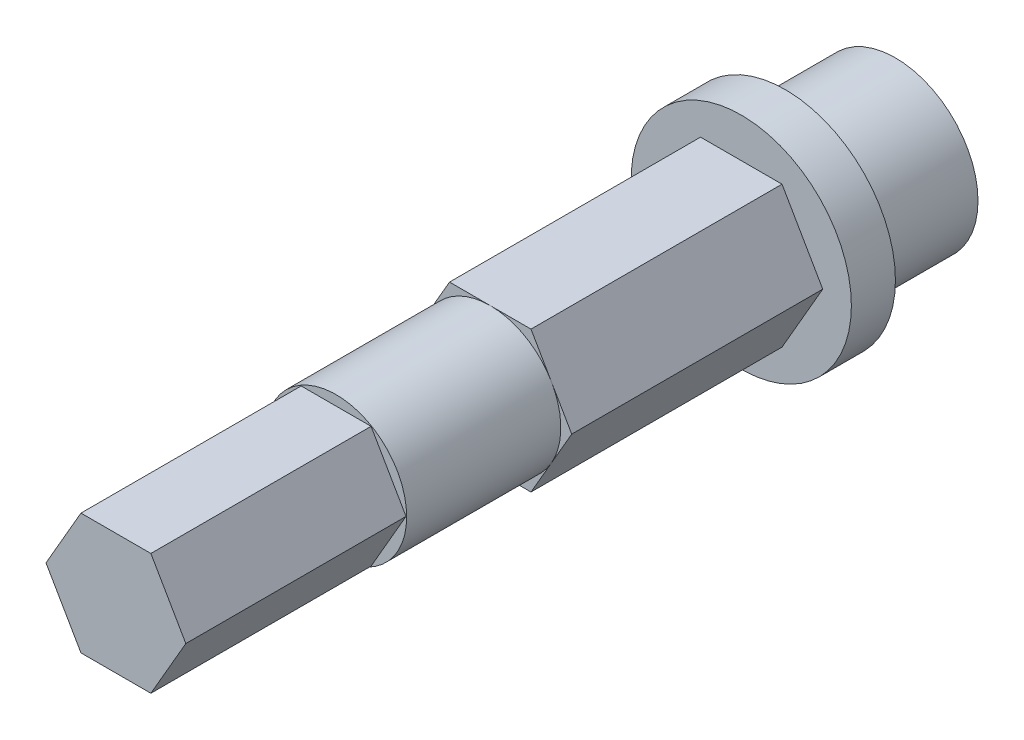
ISO-10303-21;
HEADER;
FILE_DESCRIPTION(('STEP AP214'),'2;1');
FILE_NAME('part.step','',(''),(''),'','','');
FILE_SCHEMA(('AUTOMOTIVE_DESIGN { 1 0 10303 214 1 1 1 1 }'));
ENDSEC;
DATA;
#1=APPLICATION_CONTEXT('core data for automotive mechanical design processes');
#2=APPLICATION_PROTOCOL_DEFINITION('international standard','automotive_design',2000,#1);
#3=PRODUCT_CONTEXT('',#1,'mechanical');
#4=PRODUCT('Part','Part','',(#3));
#5=PRODUCT_RELATED_PRODUCT_CATEGORY('part','',(#4));
#6=PRODUCT_DEFINITION_FORMATION('','',#4);
#7=PRODUCT_DEFINITION_CONTEXT('part definition',#1,'design');
#8=PRODUCT_DEFINITION('design','',#6,#7);
#9=PRODUCT_DEFINITION_SHAPE('','',#8);
#10=(LENGTH_UNIT() NAMED_UNIT(*) SI_UNIT(.MILLI.,.METRE.));
#11=(NAMED_UNIT(*) PLANE_ANGLE_UNIT() SI_UNIT($,.RADIAN.));
#12=(NAMED_UNIT(*) SI_UNIT($,.STERADIAN.) SOLID_ANGLE_UNIT());
#13=UNCERTAINTY_MEASURE_WITH_UNIT(LENGTH_MEASURE(1.E-05),#10,'distance_accuracy_value','');
#14=(GEOMETRIC_REPRESENTATION_CONTEXT(3) GLOBAL_UNCERTAINTY_ASSIGNED_CONTEXT((#13)) GLOBAL_UNIT_ASSIGNED_CONTEXT((#10,
#11,#12)) REPRESENTATION_CONTEXT('',''));
#15=CARTESIAN_POINT('',(0.,0.,0.));
#16=DIRECTION('',(0.,0.,1.));
#17=DIRECTION('',(1.,0.,0.));
#18=AXIS2_PLACEMENT_3D('',#15,#16,#17);
#19=CARTESIAN_POINT('',(0.,0.,18.4));
#20=DIRECTION('',(0.,0.,1.));
#21=DIRECTION('',(1.,0.,0.));
#22=AXIS2_PLACEMENT_3D('',#19,#20,#21);
#23=PLANE('',#22);
#24=CARTESIAN_POINT('',(0.,0.,18.4));
#25=DIRECTION('',(0.,0.,1.));
#26=DIRECTION('',(1.,0.,0.));
#27=AXIS2_PLACEMENT_3D('',#24,#25,#26);
#28=CIRCLE('',#27,3.20429399400242);
#29=CARTESIAN_POINT('',(2.775,1.60214699700121,18.4));
#30=VERTEX_POINT('',#29);
#31=CARTESIAN_POINT('',(0.,3.20429399400243,18.4));
#32=VERTEX_POINT('',#31);
#33=EDGE_CURVE('E51',#30,#32,#28,.T.);
#34=ORIENTED_EDGE('',*,*,#33,.F.);
#35=DIRECTION('',(-0.5,0.866025403784439,0.));
#36=VECTOR('',#35,1.);
#37=CARTESIAN_POINT('',(3.7,0.,18.4));
#38=LINE('',#37,#36);
#39=CARTESIAN_POINT('',(1.85,3.20429399400242,18.4));
#40=VERTEX_POINT('',#39);
#41=EDGE_CURVE('E191',#30,#40,#38,.T.);
#42=ORIENTED_EDGE('',*,*,#41,.T.);
#43=DIRECTION('',(-1.,0.,0.));
#44=VECTOR('',#43,1.);
#45=CARTESIAN_POINT('',(1.85,3.20429399400242,18.4));
#46=LINE('',#45,#44);
#47=EDGE_CURVE('E197',#40,#32,#46,.T.);
#48=ORIENTED_EDGE('',*,*,#47,.T.);
#49=EDGE_LOOP('',(#34,#42,#48));
#50=FACE_BOUND('',#49,.T.);
#51=ADVANCED_FACE('F39',(#50),#23,.T.);
#52=CARTESIAN_POINT('',(-2.775,1.60214699700121,18.4));
#53=VERTEX_POINT('',#52);
#54=EDGE_CURVE('E11',#32,#53,#28,.T.);
#55=ORIENTED_EDGE('',*,*,#54,.F.);
#56=CARTESIAN_POINT('',(-1.85,3.20429399400243,18.4));
#57=VERTEX_POINT('',#56);
#58=EDGE_CURVE('E196',#32,#57,#46,.T.);
#59=ORIENTED_EDGE('',*,*,#58,.T.);
#60=DIRECTION('',(-0.5,-0.866025403784439,0.));
#61=VECTOR('',#60,1.);
#62=CARTESIAN_POINT('',(-1.85,3.20429399400243,18.4));
#63=LINE('',#62,#61);
#64=EDGE_CURVE('E202',#57,#53,#63,.T.);
#65=ORIENTED_EDGE('',*,*,#64,.T.);
#66=EDGE_LOOP('',(#55,#59,#65));
#67=FACE_BOUND('',#66,.T.);
#68=ADVANCED_FACE('F296',(#67),#23,.T.);
#69=CARTESIAN_POINT('',(-2.775,-1.60214699700121,18.4));
#70=VERTEX_POINT('',#69);
#71=EDGE_CURVE('E49',#53,#70,#28,.T.);
#72=ORIENTED_EDGE('',*,*,#71,.F.);
#73=CARTESIAN_POINT('',(-3.7,0.,18.4));
#74=VERTEX_POINT('',#73);
#75=EDGE_CURVE('E201',#53,#74,#63,.T.);
#76=ORIENTED_EDGE('',*,*,#75,.T.);
#77=DIRECTION('',(0.5,-0.866025403784439,0.));
#78=VECTOR('',#77,1.);
#79=CARTESIAN_POINT('',(-3.7,0.,18.4));
#80=LINE('',#79,#78);
#81=EDGE_CURVE('E207',#74,#70,#80,.T.);
#82=ORIENTED_EDGE('',*,*,#81,.T.);
#83=EDGE_LOOP('',(#72,#76,#82));
#84=FACE_BOUND('',#83,.T.);
#85=ADVANCED_FACE('F303',(#84),#23,.T.);
#86=CARTESIAN_POINT('',(0.,-3.20429399400242,18.4));
#87=VERTEX_POINT('',#86);
#88=EDGE_CURVE('E334',#70,#87,#28,.T.);
#89=ORIENTED_EDGE('',*,*,#88,.F.);
#90=CARTESIAN_POINT('',(-1.85,-3.20429399400242,18.4));
#91=VERTEX_POINT('',#90);
#92=EDGE_CURVE('E206',#70,#91,#80,.T.);
#93=ORIENTED_EDGE('',*,*,#92,.T.);
#94=DIRECTION('',(1.,0.,0.));
#95=VECTOR('',#94,1.);
#96=CARTESIAN_POINT('',(-1.85,-3.20429399400242,18.4));
#97=LINE('',#96,#95);
#98=EDGE_CURVE('E212',#91,#87,#97,.T.);
#99=ORIENTED_EDGE('',*,*,#98,.T.);
#100=EDGE_LOOP('',(#89,#93,#99));
#101=FACE_BOUND('',#100,.T.);
#102=ADVANCED_FACE('F321',(#101),#23,.T.);
#103=CARTESIAN_POINT('',(2.775,-1.60214699700121,18.4));
#104=VERTEX_POINT('',#103);
#105=EDGE_CURVE('E278',#87,#104,#28,.T.);
#106=ORIENTED_EDGE('',*,*,#105,.F.);
#107=CARTESIAN_POINT('',(1.85,-3.20429399400243,18.4));
#108=VERTEX_POINT('',#107);
#109=EDGE_CURVE('E211',#87,#108,#97,.T.);
#110=ORIENTED_EDGE('',*,*,#109,.T.);
#111=DIRECTION('',(0.5,0.866025403784439,0.));
#112=VECTOR('',#111,1.);
#113=CARTESIAN_POINT('',(1.85,-3.20429399400243,18.4));
#114=LINE('',#113,#112);
#115=EDGE_CURVE('E187',#108,#104,#114,.T.);
#116=ORIENTED_EDGE('',*,*,#115,.T.);
#117=EDGE_LOOP('',(#106,#110,#116));
#118=FACE_BOUND('',#117,.T.);
#119=ADVANCED_FACE('F293',(#118),#23,.T.);
#120=CARTESIAN_POINT('',(0.,0.,5.));
#121=DIRECTION('',(0.,0.,-1.));
#122=DIRECTION('',(-1.,0.,0.));
#123=AXIS2_PLACEMENT_3D('',#120,#121,#122);
#124=CYLINDRICAL_SURFACE('',#123,3.75);
#125=CARTESIAN_POINT('',(0.,0.,5.));
#126=DIRECTION('',(0.,0.,1.));
#127=DIRECTION('',(1.,0.,0.));
#128=AXIS2_PLACEMENT_3D('',#125,#126,#127);
#129=CIRCLE('',#128,3.75);
#130=CARTESIAN_POINT('',(3.75,0.,5.));
#131=VERTEX_POINT('',#130);
#132=EDGE_CURVE('E270',#131,#131,#129,.T.);
#133=ORIENTED_EDGE('',*,*,#132,.F.);
#134=EDGE_LOOP('',(#133));
#135=FACE_BOUND('',#134,.T.);
#136=CARTESIAN_POINT('',(0.,0.,0.));
#137=DIRECTION('',(0.,0.,1.));
#138=DIRECTION('',(1.,0.,0.));
#139=AXIS2_PLACEMENT_3D('',#136,#137,#138);
#140=CIRCLE('',#139,3.75);
#141=CARTESIAN_POINT('',(3.75,0.,0.));
#142=VERTEX_POINT('',#141);
#143=EDGE_CURVE('E43',#142,#142,#140,.T.);
#144=ORIENTED_EDGE('',*,*,#143,.T.);
#145=EDGE_LOOP('',(#144));
#146=FACE_BOUND('',#145,.T.);
#147=ADVANCED_FACE('F41',(#135,#146),#124,.T.);
#148=CARTESIAN_POINT('',(0.,0.,0.));
#149=DIRECTION('',(0.,0.,1.));
#150=DIRECTION('',(1.,0.,0.));
#151=AXIS2_PLACEMENT_3D('',#148,#149,#150);
#152=PLANE('',#151);
#153=ORIENTED_EDGE('',*,*,#143,.F.);
#154=EDGE_LOOP('',(#153));
#155=FACE_BOUND('',#154,.T.);
#156=ADVANCED_FACE('F283',(#155),#152,.F.);
#157=CARTESIAN_POINT('',(0.,0.,7.));
#158=DIRECTION('',(0.,0.,-1.));
#159=DIRECTION('',(-1.,0.,0.));
#160=AXIS2_PLACEMENT_3D('',#157,#158,#159);
#161=CYLINDRICAL_SURFACE('',#160,5.);
#162=CARTESIAN_POINT('',(0.,0.,7.));
#163=DIRECTION('',(0.,0.,1.));
#164=DIRECTION('',(1.,0.,0.));
#165=AXIS2_PLACEMENT_3D('',#162,#163,#164);
#166=CIRCLE('',#165,5.);
#167=CARTESIAN_POINT('',(5.,0.,7.));
#168=VERTEX_POINT('',#167);
#169=EDGE_CURVE('E264',#168,#168,#166,.T.);
#170=ORIENTED_EDGE('',*,*,#169,.F.);
#171=EDGE_LOOP('',(#170));
#172=FACE_BOUND('',#171,.T.);
#173=CARTESIAN_POINT('',(0.,0.,5.));
#174=DIRECTION('',(0.,0.,1.));
#175=DIRECTION('',(1.,0.,0.));
#176=AXIS2_PLACEMENT_3D('',#173,#174,#175);
#177=CIRCLE('',#176,5.);
#178=CARTESIAN_POINT('',(5.,0.,5.));
#179=VERTEX_POINT('',#178);
#180=EDGE_CURVE('E263',#179,#179,#177,.T.);
#181=ORIENTED_EDGE('',*,*,#180,.T.);
#182=EDGE_LOOP('',(#181));
#183=FACE_BOUND('',#182,.T.);
#184=ADVANCED_FACE('F285',(#172,#183),#161,.T.);
#185=CARTESIAN_POINT('',(0.,0.,7.));
#186=DIRECTION('',(0.,0.,1.));
#187=DIRECTION('',(1.,0.,0.));
#188=AXIS2_PLACEMENT_3D('',#185,#186,#187);
#189=PLANE('',#188);
#190=DIRECTION('',(0.5,0.866025403784439,0.));
#191=VECTOR('',#190,1.);
#192=CARTESIAN_POINT('',(1.85,-3.20429399400243,7.));
#193=LINE('',#192,#191);
#194=CARTESIAN_POINT('',(1.85,-3.20429399400243,7.));
#195=VERTEX_POINT('',#194);
#196=CARTESIAN_POINT('',(3.7,0.,7.));
#197=VERTEX_POINT('',#196);
#198=EDGE_CURVE('E185',#195,#197,#193,.T.);
#199=ORIENTED_EDGE('',*,*,#198,.F.);
#200=DIRECTION('',(1.,0.,0.));
#201=VECTOR('',#200,1.);
#202=CARTESIAN_POINT('',(-1.85,-3.20429399400242,7.));
#203=LINE('',#202,#201);
#204=CARTESIAN_POINT('',(-1.85,-3.20429399400242,7.));
#205=VERTEX_POINT('',#204);
#206=EDGE_CURVE('E236',#205,#195,#203,.T.);
#207=ORIENTED_EDGE('',*,*,#206,.F.);
#208=DIRECTION('',(0.5,-0.866025403784439,0.));
#209=VECTOR('',#208,1.);
#210=CARTESIAN_POINT('',(-3.7,0.,7.));
#211=LINE('',#210,#209);
#212=CARTESIAN_POINT('',(-3.7,0.,7.));
#213=VERTEX_POINT('',#212);
#214=EDGE_CURVE('E232',#213,#205,#211,.T.);
#215=ORIENTED_EDGE('',*,*,#214,.F.);
#216=DIRECTION('',(-0.5,-0.866025403784439,0.));
#217=VECTOR('',#216,1.);
#218=CARTESIAN_POINT('',(-1.85,3.20429399400243,7.));
#219=LINE('',#218,#217);
#220=CARTESIAN_POINT('',(-1.85,3.20429399400243,7.));
#221=VERTEX_POINT('',#220);
#222=EDGE_CURVE('E228',#221,#213,#219,.T.);
#223=ORIENTED_EDGE('',*,*,#222,.F.);
#224=DIRECTION('',(-1.,0.,0.));
#225=VECTOR('',#224,1.);
#226=CARTESIAN_POINT('',(1.85,3.20429399400242,7.));
#227=LINE('',#226,#225);
#228=CARTESIAN_POINT('',(1.85,3.20429399400242,7.));
#229=VERTEX_POINT('',#228);
#230=EDGE_CURVE('E224',#229,#221,#227,.T.);
#231=ORIENTED_EDGE('',*,*,#230,.F.);
#232=DIRECTION('',(-0.5,0.866025403784439,0.));
#233=VECTOR('',#232,1.);
#234=CARTESIAN_POINT('',(3.7,0.,7.));
#235=LINE('',#234,#233);
#236=EDGE_CURVE('E220',#197,#229,#235,.T.);
#237=ORIENTED_EDGE('',*,*,#236,.F.);
#238=EDGE_LOOP('',(#199,#207,#215,#223,#231,#237));
#239=FACE_BOUND('',#238,.T.);
#240=ORIENTED_EDGE('',*,*,#169,.T.);
#241=EDGE_LOOP('',(#240));
#242=FACE_BOUND('',#241,.T.);
#243=ADVANCED_FACE('F290',(#239,#242),#189,.T.);
#244=CARTESIAN_POINT('',(0.,0.,5.));
#245=DIRECTION('',(0.,0.,1.));
#246=DIRECTION('',(1.,0.,0.));
#247=AXIS2_PLACEMENT_3D('',#244,#245,#246);
#248=PLANE('',#247);
#249=ORIENTED_EDGE('',*,*,#132,.T.);
#250=EDGE_LOOP('',(#249));
#251=FACE_BOUND('',#250,.T.);
#252=ORIENTED_EDGE('',*,*,#180,.F.);
#253=EDGE_LOOP('',(#252));
#254=FACE_BOUND('',#253,.T.);
#255=ADVANCED_FACE('F372',(#251,#254),#248,.F.);
#256=CARTESIAN_POINT('',(1.85,-3.20429399400243,18.4));
#257=DIRECTION('',(-0.866025403784439,0.5,0.));
#258=DIRECTION('',(-0.5,-0.866025403784439,0.));
#259=AXIS2_PLACEMENT_3D('',#256,#257,#258);
#260=PLANE('',#259);
#261=ORIENTED_EDGE('',*,*,#198,.T.);
#262=DIRECTION('',(0.,0.,-1.));
#263=VECTOR('',#262,1.);
#264=CARTESIAN_POINT('',(3.7,0.,18.4));
#265=LINE('',#264,#263);
#266=CARTESIAN_POINT('',(3.7,0.,18.4));
#267=VERTEX_POINT('',#266);
#268=EDGE_CURVE('E259',#267,#197,#265,.T.);
#269=ORIENTED_EDGE('',*,*,#268,.F.);
#270=EDGE_CURVE('E192',#104,#267,#114,.T.);
#271=ORIENTED_EDGE('',*,*,#270,.F.);
#272=ORIENTED_EDGE('',*,*,#115,.F.);
#273=DIRECTION('',(0.,0.,-1.));
#274=VECTOR('',#273,1.);
#275=CARTESIAN_POINT('',(1.85,-3.20429399400243,18.4));
#276=LINE('',#275,#274);
#277=EDGE_CURVE('E216',#108,#195,#276,.T.);
#278=ORIENTED_EDGE('',*,*,#277,.T.);
#279=EDGE_LOOP('',(#261,#269,#271,#272,#278));
#280=FACE_BOUND('',#279,.T.);
#281=ADVANCED_FACE('F369',(#280),#260,.F.);
#282=CARTESIAN_POINT('',(3.7,0.,18.4));
#283=DIRECTION('',(-0.866025403784439,-0.5,0.));
#284=DIRECTION('',(0.5,-0.866025403784439,0.));
#285=AXIS2_PLACEMENT_3D('',#282,#283,#284);
#286=PLANE('',#285);
#287=ORIENTED_EDGE('',*,*,#236,.T.);
#288=DIRECTION('',(0.,0.,-1.));
#289=VECTOR('',#288,1.);
#290=CARTESIAN_POINT('',(1.85,3.20429399400242,18.4));
#291=LINE('',#290,#289);
#292=EDGE_CURVE('E255',#40,#229,#291,.T.);
#293=ORIENTED_EDGE('',*,*,#292,.F.);
#294=ORIENTED_EDGE('',*,*,#41,.F.);
#295=EDGE_CURVE('E193',#267,#30,#38,.T.);
#296=ORIENTED_EDGE('',*,*,#295,.F.);
#297=ORIENTED_EDGE('',*,*,#268,.T.);
#298=EDGE_LOOP('',(#287,#293,#294,#296,#297));
#299=FACE_BOUND('',#298,.T.);
#300=ADVANCED_FACE('F367',(#299),#286,.F.);
#301=CARTESIAN_POINT('',(1.85,3.20429399400242,18.4));
#302=DIRECTION('',(0.,-1.,0.));
#303=DIRECTION('',(1.,0.,0.));
#304=AXIS2_PLACEMENT_3D('',#301,#302,#303);
#305=PLANE('',#304);
#306=ORIENTED_EDGE('',*,*,#230,.T.);
#307=DIRECTION('',(0.,0.,-1.));
#308=VECTOR('',#307,1.);
#309=CARTESIAN_POINT('',(-1.85,3.20429399400243,18.4));
#310=LINE('',#309,#308);
#311=EDGE_CURVE('E251',#57,#221,#310,.T.);
#312=ORIENTED_EDGE('',*,*,#311,.F.);
#313=ORIENTED_EDGE('',*,*,#58,.F.);
#314=ORIENTED_EDGE('',*,*,#47,.F.);
#315=ORIENTED_EDGE('',*,*,#292,.T.);
#316=EDGE_LOOP('',(#306,#312,#313,#314,#315));
#317=FACE_BOUND('',#316,.T.);
#318=ADVANCED_FACE('F355',(#317),#305,.F.);
#319=CARTESIAN_POINT('',(-1.85,3.20429399400243,18.4));
#320=DIRECTION('',(0.866025403784439,-0.5,0.));
#321=DIRECTION('',(0.5,0.866025403784439,0.));
#322=AXIS2_PLACEMENT_3D('',#319,#320,#321);
#323=PLANE('',#322);
#324=ORIENTED_EDGE('',*,*,#222,.T.);
#325=DIRECTION('',(0.,0.,-1.));
#326=VECTOR('',#325,1.);
#327=CARTESIAN_POINT('',(-3.7,0.,18.4));
#328=LINE('',#327,#326);
#329=EDGE_CURVE('E247',#74,#213,#328,.T.);
#330=ORIENTED_EDGE('',*,*,#329,.F.);
#331=ORIENTED_EDGE('',*,*,#75,.F.);
#332=ORIENTED_EDGE('',*,*,#64,.F.);
#333=ORIENTED_EDGE('',*,*,#311,.T.);
#334=EDGE_LOOP('',(#324,#330,#331,#332,#333));
#335=FACE_BOUND('',#334,.T.);
#336=ADVANCED_FACE('F348',(#335),#323,.F.);
#337=CARTESIAN_POINT('',(-3.7,0.,18.4));
#338=DIRECTION('',(0.866025403784439,0.5,0.));
#339=DIRECTION('',(-0.5,0.866025403784439,0.));
#340=AXIS2_PLACEMENT_3D('',#337,#338,#339);
#341=PLANE('',#340);
#342=ORIENTED_EDGE('',*,*,#214,.T.);
#343=DIRECTION('',(0.,0.,-1.));
#344=VECTOR('',#343,1.);
#345=CARTESIAN_POINT('',(-1.85,-3.20429399400242,18.4));
#346=LINE('',#345,#344);
#347=EDGE_CURVE('E243',#91,#205,#346,.T.);
#348=ORIENTED_EDGE('',*,*,#347,.F.);
#349=ORIENTED_EDGE('',*,*,#92,.F.);
#350=ORIENTED_EDGE('',*,*,#81,.F.);
#351=ORIENTED_EDGE('',*,*,#329,.T.);
#352=EDGE_LOOP('',(#342,#348,#349,#350,#351));
#353=FACE_BOUND('',#352,.T.);
#354=ADVANCED_FACE('F318',(#353),#341,.F.);
#355=CARTESIAN_POINT('',(-1.85,-3.20429399400242,18.4));
#356=DIRECTION('',(0.,1.,0.));
#357=DIRECTION('',(-1.,0.,0.));
#358=AXIS2_PLACEMENT_3D('',#355,#356,#357);
#359=PLANE('',#358);
#360=ORIENTED_EDGE('',*,*,#206,.T.);
#361=ORIENTED_EDGE('',*,*,#277,.F.);
#362=ORIENTED_EDGE('',*,*,#109,.F.);
#363=ORIENTED_EDGE('',*,*,#98,.F.);
#364=ORIENTED_EDGE('',*,*,#347,.T.);
#365=EDGE_LOOP('',(#360,#361,#362,#363,#364));
#366=FACE_BOUND('',#365,.T.);
#367=ADVANCED_FACE('F310',(#366),#359,.F.);
#368=EDGE_CURVE('E178',#104,#30,#28,.T.);
#369=ORIENTED_EDGE('',*,*,#368,.F.);
#370=ORIENTED_EDGE('',*,*,#270,.T.);
#371=ORIENTED_EDGE('',*,*,#295,.T.);
#372=EDGE_LOOP('',(#369,#370,#371));
#373=FACE_BOUND('',#372,.T.);
#374=ADVANCED_FACE('F299',(#373),#23,.T.);
#375=CARTESIAN_POINT('',(0.,0.,25.4));
#376=DIRECTION('',(0.,0.,-1.));
#377=DIRECTION('',(-1.,0.,0.));
#378=AXIS2_PLACEMENT_3D('',#375,#376,#377);
#379=CYLINDRICAL_SURFACE('',#378,3.20429399400242);
#380=CARTESIAN_POINT('',(0.,0.,25.4));
#381=DIRECTION('',(0.,0.,1.));
#382=DIRECTION('',(1.,0.,0.));
#383=AXIS2_PLACEMENT_3D('',#380,#381,#382);
#384=CIRCLE('',#383,3.20429399400242);
#385=CARTESIAN_POINT('',(3.20429399400242,0.,25.4));
#386=VERTEX_POINT('',#385);
#387=EDGE_CURVE('E177',#386,#386,#384,.T.);
#388=ORIENTED_EDGE('',*,*,#387,.F.);
#389=EDGE_LOOP('',(#388));
#390=FACE_BOUND('',#389,.T.);
#391=ORIENTED_EDGE('',*,*,#33,.T.);
#392=ORIENTED_EDGE('',*,*,#54,.T.);
#393=ORIENTED_EDGE('',*,*,#71,.T.);
#394=ORIENTED_EDGE('',*,*,#88,.T.);
#395=ORIENTED_EDGE('',*,*,#105,.T.);
#396=ORIENTED_EDGE('',*,*,#368,.T.);
#397=EDGE_LOOP('',(#391,#392,#393,#394,#395,#396));
#398=FACE_BOUND('',#397,.T.);
#399=ADVANCED_FACE('F309',(#390,#398),#379,.T.);
#400=CARTESIAN_POINT('',(0.,0.,25.4));
#401=DIRECTION('',(0.,0.,1.));
#402=DIRECTION('',(1.,0.,0.));
#403=AXIS2_PLACEMENT_3D('',#400,#401,#402);
#404=PLANE('',#403);
#405=DIRECTION('',(0.5,0.866025403784439,0.));
#406=VECTOR('',#405,1.);
#407=CARTESIAN_POINT('',(1.5875,-2.74963065701559,25.4));
#408=LINE('',#407,#406);
#409=CARTESIAN_POINT('',(1.5875,-2.74963065701559,25.4));
#410=VERTEX_POINT('',#409);
#411=CARTESIAN_POINT('',(3.175,0.,25.4));
#412=VERTEX_POINT('',#411);
#413=EDGE_CURVE('E58',#410,#412,#408,.T.);
#414=ORIENTED_EDGE('',*,*,#413,.F.);
#415=DIRECTION('',(1.,0.,0.));
#416=VECTOR('',#415,1.);
#417=CARTESIAN_POINT('',(-1.5875,-2.74963065701559,25.4));
#418=LINE('',#417,#416);
#419=CARTESIAN_POINT('',(-1.5875,-2.74963065701559,25.4));
#420=VERTEX_POINT('',#419);
#421=EDGE_CURVE('E62',#420,#410,#418,.T.);
#422=ORIENTED_EDGE('',*,*,#421,.F.);
#423=DIRECTION('',(0.5,-0.866025403784439,0.));
#424=VECTOR('',#423,1.);
#425=CARTESIAN_POINT('',(-3.175,0.,25.4));
#426=LINE('',#425,#424);
#427=CARTESIAN_POINT('',(-3.175,0.,25.4));
#428=VERTEX_POINT('',#427);
#429=EDGE_CURVE('E491',#428,#420,#426,.T.);
#430=ORIENTED_EDGE('',*,*,#429,.F.);
#431=DIRECTION('',(-0.5,-0.866025403784439,0.));
#432=VECTOR('',#431,1.);
#433=CARTESIAN_POINT('',(-1.5875,2.74963065701559,25.4));
#434=LINE('',#433,#432);
#435=CARTESIAN_POINT('',(-1.5875,2.74963065701559,25.4));
#436=VERTEX_POINT('',#435);
#437=EDGE_CURVE('E511',#436,#428,#434,.T.);
#438=ORIENTED_EDGE('',*,*,#437,.F.);
#439=DIRECTION('',(-1.,0.,0.));
#440=VECTOR('',#439,1.);
#441=CARTESIAN_POINT('',(1.5875,2.74963065701559,25.4));
#442=LINE('',#441,#440);
#443=CARTESIAN_POINT('',(1.5875,2.74963065701559,25.4));
#444=VERTEX_POINT('',#443);
#445=EDGE_CURVE('E514',#444,#436,#442,.T.);
#446=ORIENTED_EDGE('',*,*,#445,.F.);
#447=DIRECTION('',(-0.5,0.866025403784439,0.));
#448=VECTOR('',#447,1.);
#449=CARTESIAN_POINT('',(3.175,0.,25.4));
#450=LINE('',#449,#448);
#451=EDGE_CURVE('E516',#412,#444,#450,.T.);
#452=ORIENTED_EDGE('',*,*,#451,.F.);
#453=EDGE_LOOP('',(#414,#422,#430,#438,#446,#452));
#454=FACE_BOUND('',#453,.T.);
#455=ORIENTED_EDGE('',*,*,#387,.T.);
#456=EDGE_LOOP('',(#455));
#457=FACE_BOUND('',#456,.T.);
#458=ADVANCED_FACE('F316',(#454,#457),#404,.T.);
#459=CARTESIAN_POINT('',(1.5875,-2.74963065701559,35.4));
#460=DIRECTION('',(-0.866025403784439,0.5,0.));
#461=DIRECTION('',(-0.5,-0.866025403784439,0.));
#462=AXIS2_PLACEMENT_3D('',#459,#460,#461);
#463=PLANE('',#462);
#464=ORIENTED_EDGE('',*,*,#413,.T.);
#465=DIRECTION('',(0.,0.,-1.));
#466=VECTOR('',#465,1.);
#467=CARTESIAN_POINT('',(3.175,0.,35.4));
#468=LINE('',#467,#466);
#469=CARTESIAN_POINT('',(3.175,0.,35.4));
#470=VERTEX_POINT('',#469);
#471=EDGE_CURVE('E153',#470,#412,#468,.T.);
#472=ORIENTED_EDGE('',*,*,#471,.F.);
#473=DIRECTION('',(0.5,0.866025403784439,0.));
#474=VECTOR('',#473,1.);
#475=CARTESIAN_POINT('',(1.5875,-2.74963065701559,35.4));
#476=LINE('',#475,#474);
#477=CARTESIAN_POINT('',(1.5875,-2.74963065701559,35.4));
#478=VERTEX_POINT('',#477);
#479=EDGE_CURVE('E160',#478,#470,#476,.T.);
#480=ORIENTED_EDGE('',*,*,#479,.F.);
#481=DIRECTION('',(0.,0.,-1.));
#482=VECTOR('',#481,1.);
#483=CARTESIAN_POINT('',(1.5875,-2.74963065701559,35.4));
#484=LINE('',#483,#482);
#485=EDGE_CURVE('E487',#478,#410,#484,.T.);
#486=ORIENTED_EDGE('',*,*,#485,.T.);
#487=EDGE_LOOP('',(#464,#472,#480,#486));
#488=FACE_BOUND('',#487,.T.);
#489=ADVANCED_FACE('F171',(#488),#463,.F.);
#490=CARTESIAN_POINT('',(3.175,0.,35.4));
#491=DIRECTION('',(-0.866025403784439,-0.5,0.));
#492=DIRECTION('',(0.5,-0.866025403784439,0.));
#493=AXIS2_PLACEMENT_3D('',#490,#491,#492);
#494=PLANE('',#493);
#495=ORIENTED_EDGE('',*,*,#451,.T.);
#496=DIRECTION('',(0.,0.,-1.));
#497=VECTOR('',#496,1.);
#498=CARTESIAN_POINT('',(1.5875,2.74963065701559,35.4));
#499=LINE('',#498,#497);
#500=CARTESIAN_POINT('',(1.5875,2.74963065701559,35.4));
#501=VERTEX_POINT('',#500);
#502=EDGE_CURVE('E155',#501,#444,#499,.T.);
#503=ORIENTED_EDGE('',*,*,#502,.F.);
#504=DIRECTION('',(-0.5,0.866025403784439,0.));
#505=VECTOR('',#504,1.);
#506=CARTESIAN_POINT('',(3.175,0.,35.4));
#507=LINE('',#506,#505);
#508=EDGE_CURVE('E148',#470,#501,#507,.T.);
#509=ORIENTED_EDGE('',*,*,#508,.F.);
#510=ORIENTED_EDGE('',*,*,#471,.T.);
#511=EDGE_LOOP('',(#495,#503,#509,#510));
#512=FACE_BOUND('',#511,.T.);
#513=ADVANCED_FACE('F151',(#512),#494,.F.);
#514=CARTESIAN_POINT('',(1.5875,2.74963065701559,35.4));
#515=DIRECTION('',(0.,-1.,0.));
#516=DIRECTION('',(0.,0.,-1.));
#517=AXIS2_PLACEMENT_3D('',#514,#515,#516);
#518=PLANE('',#517);
#519=ORIENTED_EDGE('',*,*,#445,.T.);
#520=DIRECTION('',(0.,0.,-1.));
#521=VECTOR('',#520,1.);
#522=CARTESIAN_POINT('',(-1.5875,2.74963065701559,35.4));
#523=LINE('',#522,#521);
#524=CARTESIAN_POINT('',(-1.5875,2.74963065701559,35.4));
#525=VERTEX_POINT('',#524);
#526=EDGE_CURVE('E179',#525,#436,#523,.T.);
#527=ORIENTED_EDGE('',*,*,#526,.F.);
#528=DIRECTION('',(-1.,0.,0.));
#529=VECTOR('',#528,1.);
#530=CARTESIAN_POINT('',(1.5875,2.74963065701559,35.4));
#531=LINE('',#530,#529);
#532=EDGE_CURVE('E159',#501,#525,#531,.T.);
#533=ORIENTED_EDGE('',*,*,#532,.F.);
#534=ORIENTED_EDGE('',*,*,#502,.T.);
#535=EDGE_LOOP('',(#519,#527,#533,#534));
#536=FACE_BOUND('',#535,.T.);
#537=ADVANCED_FACE('F435',(#536),#518,.F.);
#538=CARTESIAN_POINT('',(-1.5875,2.74963065701559,35.4));
#539=DIRECTION('',(0.866025403784439,-0.5,0.));
#540=DIRECTION('',(0.5,0.866025403784439,0.));
#541=AXIS2_PLACEMENT_3D('',#538,#539,#540);
#542=PLANE('',#541);
#543=ORIENTED_EDGE('',*,*,#437,.T.);
#544=DIRECTION('',(0.,0.,-1.));
#545=VECTOR('',#544,1.);
#546=CARTESIAN_POINT('',(-3.175,0.,35.4));
#547=LINE('',#546,#545);
#548=CARTESIAN_POINT('',(-3.175,0.,35.4));
#549=VERTEX_POINT('',#548);
#550=EDGE_CURVE('E497',#549,#428,#547,.T.);
#551=ORIENTED_EDGE('',*,*,#550,.F.);
#552=DIRECTION('',(-0.5,-0.866025403784439,0.));
#553=VECTOR('',#552,1.);
#554=CARTESIAN_POINT('',(-1.5875,2.74963065701559,35.4));
#555=LINE('',#554,#553);
#556=EDGE_CURVE('E512',#525,#549,#555,.T.);
#557=ORIENTED_EDGE('',*,*,#556,.F.);
#558=ORIENTED_EDGE('',*,*,#526,.T.);
#559=EDGE_LOOP('',(#543,#551,#557,#558));
#560=FACE_BOUND('',#559,.T.);
#561=ADVANCED_FACE('F444',(#560),#542,.F.);
#562=CARTESIAN_POINT('',(-3.175,0.,35.4));
#563=DIRECTION('',(0.866025403784439,0.5,0.));
#564=DIRECTION('',(-0.5,0.866025403784439,0.));
#565=AXIS2_PLACEMENT_3D('',#562,#563,#564);
#566=PLANE('',#565);
#567=ORIENTED_EDGE('',*,*,#429,.T.);
#568=DIRECTION('',(0.,0.,-1.));
#569=VECTOR('',#568,1.);
#570=CARTESIAN_POINT('',(-1.5875,-2.74963065701559,35.4));
#571=LINE('',#570,#569);
#572=CARTESIAN_POINT('',(-1.5875,-2.74963065701559,35.4));
#573=VERTEX_POINT('',#572);
#574=EDGE_CURVE('E489',#573,#420,#571,.T.);
#575=ORIENTED_EDGE('',*,*,#574,.F.);
#576=DIRECTION('',(0.5,-0.866025403784439,0.));
#577=VECTOR('',#576,1.);
#578=CARTESIAN_POINT('',(-3.175,0.,35.4));
#579=LINE('',#578,#577);
#580=EDGE_CURVE('E499',#549,#573,#579,.T.);
#581=ORIENTED_EDGE('',*,*,#580,.F.);
#582=ORIENTED_EDGE('',*,*,#550,.T.);
#583=EDGE_LOOP('',(#567,#575,#581,#582));
#584=FACE_BOUND('',#583,.T.);
#585=ADVANCED_FACE('F454',(#584),#566,.F.);
#586=CARTESIAN_POINT('',(-1.5875,-2.74963065701559,35.4));
#587=DIRECTION('',(0.,1.,0.));
#588=DIRECTION('',(0.,0.,1.));
#589=AXIS2_PLACEMENT_3D('',#586,#587,#588);
#590=PLANE('',#589);
#591=ORIENTED_EDGE('',*,*,#421,.T.);
#592=ORIENTED_EDGE('',*,*,#485,.F.);
#593=DIRECTION('',(1.,0.,0.));
#594=VECTOR('',#593,1.);
#595=CARTESIAN_POINT('',(-1.5875,-2.74963065701559,35.4));
#596=LINE('',#595,#594);
#597=EDGE_CURVE('E165',#573,#478,#596,.T.);
#598=ORIENTED_EDGE('',*,*,#597,.F.);
#599=ORIENTED_EDGE('',*,*,#574,.T.);
#600=EDGE_LOOP('',(#591,#592,#598,#599));
#601=FACE_BOUND('',#600,.T.);
#602=ADVANCED_FACE('F464',(#601),#590,.F.);
#603=CARTESIAN_POINT('',(0.,0.,35.4));
#604=DIRECTION('',(0.,0.,1.));
#605=DIRECTION('',(1.,0.,0.));
#606=AXIS2_PLACEMENT_3D('',#603,#604,#605);
#607=PLANE('',#606);
#608=ORIENTED_EDGE('',*,*,#479,.T.);
#609=ORIENTED_EDGE('',*,*,#508,.T.);
#610=ORIENTED_EDGE('',*,*,#532,.T.);
#611=ORIENTED_EDGE('',*,*,#556,.T.);
#612=ORIENTED_EDGE('',*,*,#580,.T.);
#613=ORIENTED_EDGE('',*,*,#597,.T.);
#614=EDGE_LOOP('',(#608,#609,#610,#611,#612,#613));
#615=FACE_BOUND('',#614,.T.);
#616=ADVANCED_FACE('F163',(#615),#607,.T.);
#617=CLOSED_SHELL('',(#51,#68,#85,#102,#119,#147,#156,#184,#243,#255,#281,#300,#318,#336,#354,
#367,#374,#399,#458,#489,#513,#537,#561,#585,#602,#616));
#618=MANIFOLD_SOLID_BREP('B2',#617);
#619=ADVANCED_BREP_SHAPE_REPRESENTATION('',(#18,#618),#14);
#620=SHAPE_DEFINITION_REPRESENTATION(#9,#619);
ENDSEC;
END-ISO-10303-21;
